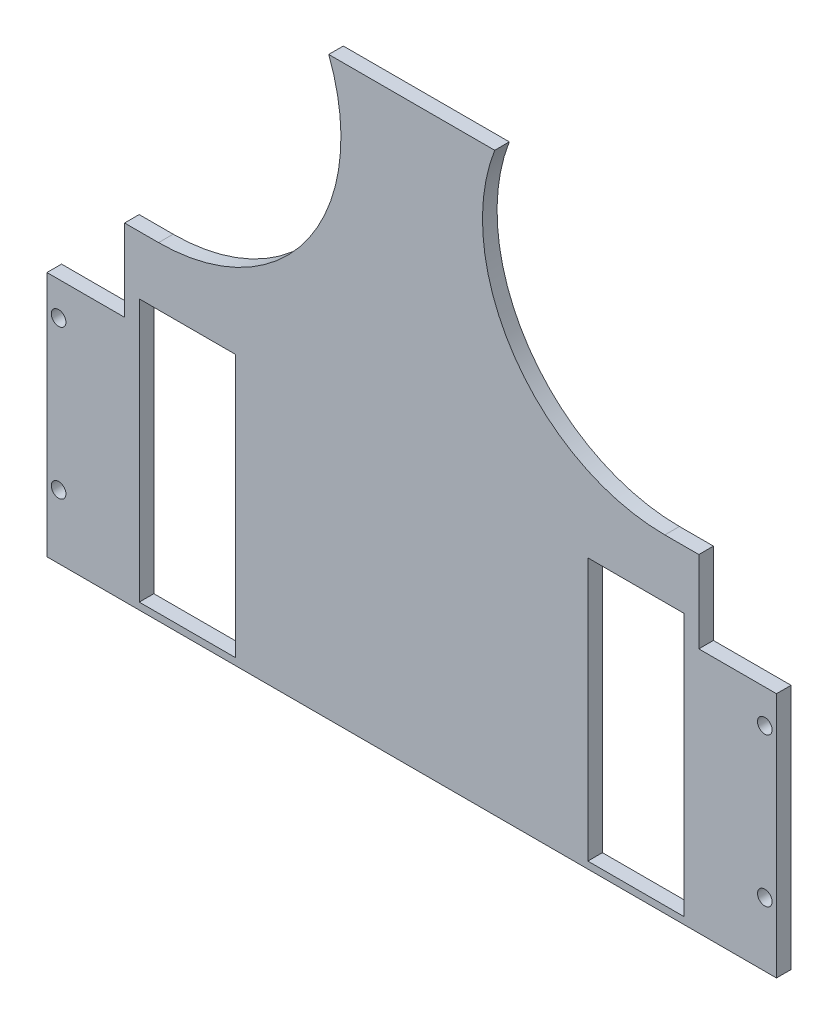
ISO-10303-21;
HEADER;
FILE_DESCRIPTION(('STEP AP214'),'2;1');
FILE_NAME('part.step','',(''),(''),'','','');
FILE_SCHEMA(('AUTOMOTIVE_DESIGN { 1 0 10303 214 1 1 1 1 }'));
ENDSEC;
DATA;
#1=APPLICATION_CONTEXT('core data for automotive mechanical design processes');
#2=APPLICATION_PROTOCOL_DEFINITION('international standard','automotive_design',2000,#1);
#3=PRODUCT_CONTEXT('',#1,'mechanical');
#4=PRODUCT('Part','Part','',(#3));
#5=PRODUCT_RELATED_PRODUCT_CATEGORY('part','',(#4));
#6=PRODUCT_DEFINITION_FORMATION('','',#4);
#7=PRODUCT_DEFINITION_CONTEXT('part definition',#1,'design');
#8=PRODUCT_DEFINITION('design','',#6,#7);
#9=PRODUCT_DEFINITION_SHAPE('','',#8);
#10=(LENGTH_UNIT() NAMED_UNIT(*) SI_UNIT(.MILLI.,.METRE.));
#11=(NAMED_UNIT(*) PLANE_ANGLE_UNIT() SI_UNIT($,.RADIAN.));
#12=(NAMED_UNIT(*) SI_UNIT($,.STERADIAN.) SOLID_ANGLE_UNIT());
#13=UNCERTAINTY_MEASURE_WITH_UNIT(LENGTH_MEASURE(1.E-05),#10,'distance_accuracy_value','');
#14=(GEOMETRIC_REPRESENTATION_CONTEXT(3) GLOBAL_UNCERTAINTY_ASSIGNED_CONTEXT((#13)) GLOBAL_UNIT_ASSIGNED_CONTEXT((#10,
#11,#12)) REPRESENTATION_CONTEXT('',''));
#15=CARTESIAN_POINT('',(0.,0.,0.));
#16=DIRECTION('',(0.,0.,1.));
#17=DIRECTION('',(1.,0.,0.));
#18=AXIS2_PLACEMENT_3D('',#15,#16,#17);
#19=CARTESIAN_POINT('',(0.,0.,5.));
#20=DIRECTION('',(0.,0.,1.));
#21=DIRECTION('',(1.,0.,0.));
#22=AXIS2_PLACEMENT_3D('',#19,#20,#21);
#23=PLANE('',#22);
#24=DIRECTION('',(1.,0.,0.));
#25=VECTOR('',#24,1.);
#26=CARTESIAN_POINT('',(-3397.43241786822,-182.000000000022,5.));
#27=LINE('',#26,#25);
#28=CARTESIAN_POINT('',(-3397.43241786822,-182.000000000022,5.));
#29=VERTEX_POINT('',#28);
#30=CARTESIAN_POINT('',(-3370.82807951019,-182.000000000022,5.));
#31=VERTEX_POINT('',#30);
#32=EDGE_CURVE('E338',#29,#31,#27,.T.);
#33=ORIENTED_EDGE('',*,*,#32,.F.);
#34=DIRECTION('',(0.,-1.,0.));
#35=VECTOR('',#34,1.);
#36=CARTESIAN_POINT('',(-3397.43241786822,-69.0000000000222,5.));
#37=LINE('',#36,#35);
#38=CARTESIAN_POINT('',(-3397.43241786822,-266.375602835039,5.));
#39=VERTEX_POINT('',#38);
#40=EDGE_CURVE('E204',#29,#39,#37,.T.);
#41=ORIENTED_EDGE('',*,*,#40,.T.);
#42=DIRECTION('',(-1.,0.,0.));
#43=VECTOR('',#42,1.);
#44=CARTESIAN_POINT('',(-3397.43241786822,-266.375602835039,5.));
#45=LINE('',#44,#43);
#46=CARTESIAN_POINT('',(-3147.43241786822,-266.375602835039,5.));
#47=VERTEX_POINT('',#46);
#48=EDGE_CURVE('E175',#47,#39,#45,.T.);
#49=ORIENTED_EDGE('',*,*,#48,.F.);
#50=DIRECTION('',(0.,1.,0.));
#51=VECTOR('',#50,1.);
#52=CARTESIAN_POINT('',(-3147.43241786822,-69.0000000000221,5.));
#53=LINE('',#52,#51);
#54=CARTESIAN_POINT('',(-3147.43241786822,-182.000000000022,5.));
#55=VERTEX_POINT('',#54);
#56=EDGE_CURVE('E44',#47,#55,#53,.T.);
#57=ORIENTED_EDGE('',*,*,#56,.T.);
#58=DIRECTION('',(1.,0.,0.));
#59=VECTOR('',#58,1.);
#60=CARTESIAN_POINT('',(-3147.43241786822,-182.000000000022,5.));
#61=LINE('',#60,#59);
#62=CARTESIAN_POINT('',(-3174.03675622624,-182.000000000022,5.));
#63=VERTEX_POINT('',#62);
#64=EDGE_CURVE('E300',#63,#55,#61,.T.);
#65=ORIENTED_EDGE('',*,*,#64,.F.);
#66=DIRECTION('',(0.,-1.,0.));
#67=VECTOR('',#66,1.);
#68=CARTESIAN_POINT('',(-3174.03675622624,-182.000000000022,5.));
#69=LINE('',#68,#67);
#70=CARTESIAN_POINT('',(-3174.03675622624,-154.000000000022,5.));
#71=VERTEX_POINT('',#70);
#72=EDGE_CURVE('E303',#71,#63,#69,.T.);
#73=ORIENTED_EDGE('',*,*,#72,.F.);
#74=DIRECTION('',(1.,0.,0.));
#75=VECTOR('',#74,1.);
#76=CARTESIAN_POINT('',(-3174.03675622624,-154.000000000022,5.));
#77=LINE('',#76,#75);
#78=CARTESIAN_POINT('',(-3185.68281037631,-154.000000000022,5.));
#79=VERTEX_POINT('',#78);
#80=EDGE_CURVE('E306',#79,#71,#77,.T.);
#81=ORIENTED_EDGE('',*,*,#80,.F.);
#82=CARTESIAN_POINT('',(-3185.68281037631,-91.5000000000222,5.));
#83=DIRECTION('',(0.,0.,1.));
#84=DIRECTION('',(-1.,0.,0.));
#85=AXIS2_PLACEMENT_3D('',#82,#83,#84);
#86=CIRCLE('',#85,62.5);
#87=CARTESIAN_POINT('',(-3243.99232932476,-69.0000000000221,5.));
#88=VERTEX_POINT('',#87);
#89=EDGE_CURVE('E180',#88,#79,#86,.T.);
#90=ORIENTED_EDGE('',*,*,#89,.F.);
#91=DIRECTION('',(-1.,0.,0.));
#92=VECTOR('',#91,1.);
#93=CARTESIAN_POINT('',(-3397.43241786822,-69.0000000000222,5.));
#94=LINE('',#93,#92);
#95=CARTESIAN_POINT('',(-3300.87250641167,-69.0000000000221,5.));
#96=VERTEX_POINT('',#95);
#97=EDGE_CURVE('E11',#88,#96,#94,.T.);
#98=ORIENTED_EDGE('',*,*,#97,.T.);
#99=CARTESIAN_POINT('',(-3359.18202536013,-91.5000000000221,5.));
#100=DIRECTION('',(0.,0.,1.));
#101=DIRECTION('',(1.,0.,0.));
#102=AXIS2_PLACEMENT_3D('',#99,#100,#101);
#103=CIRCLE('',#102,62.5);
#104=CARTESIAN_POINT('',(-3359.18202536013,-154.000000000022,5.));
#105=VERTEX_POINT('',#104);
#106=EDGE_CURVE('E60',#105,#96,#103,.T.);
#107=ORIENTED_EDGE('',*,*,#106,.F.);
#108=DIRECTION('',(1.,0.,0.));
#109=VECTOR('',#108,1.);
#110=CARTESIAN_POINT('',(-3370.82807951019,-154.000000000022,5.));
#111=LINE('',#110,#109);
#112=CARTESIAN_POINT('',(-3370.82807951019,-154.000000000022,5.));
#113=VERTEX_POINT('',#112);
#114=EDGE_CURVE('E332',#113,#105,#111,.T.);
#115=ORIENTED_EDGE('',*,*,#114,.F.);
#116=DIRECTION('',(0.,1.,0.));
#117=VECTOR('',#116,1.);
#118=CARTESIAN_POINT('',(-3370.82807951019,-182.000000000022,5.));
#119=LINE('',#118,#117);
#120=EDGE_CURVE('E335',#31,#113,#119,.T.);
#121=ORIENTED_EDGE('',*,*,#120,.F.);
#122=EDGE_LOOP('',(#33,#41,#49,#57,#65,#73,#81,#90,#98,#107,#115,#121));
#123=FACE_BOUND('',#122,.T.);
#124=CARTESIAN_POINT('',(-3393.43241786822,-244.500000000019,5.));
#125=DIRECTION('',(0.,0.,1.));
#126=DIRECTION('',(-1.,0.,0.));
#127=AXIS2_PLACEMENT_3D('',#124,#125,#126);
#128=CIRCLE('',#127,2.50000000000012);
#129=CARTESIAN_POINT('',(-3395.93241786822,-244.500000000019,5.));
#130=VERTEX_POINT('',#129);
#131=EDGE_CURVE('E243',#130,#130,#128,.T.);
#132=ORIENTED_EDGE('',*,*,#131,.F.);
#133=EDGE_LOOP('',(#132));
#134=FACE_BOUND('',#133,.T.);
#135=CARTESIAN_POINT('',(-3151.43241786822,-193.500000000019,5.));
#136=DIRECTION('',(0.,0.,1.));
#137=DIRECTION('',(1.,0.,0.));
#138=AXIS2_PLACEMENT_3D('',#135,#136,#137);
#139=CIRCLE('',#138,2.50000000000012);
#140=CARTESIAN_POINT('',(-3148.93241786822,-193.500000000019,5.));
#141=VERTEX_POINT('',#140);
#142=EDGE_CURVE('E226',#141,#141,#139,.T.);
#143=ORIENTED_EDGE('',*,*,#142,.F.);
#144=EDGE_LOOP('',(#143));
#145=FACE_BOUND('',#144,.T.);
#146=DIRECTION('',(1.,0.,0.));
#147=VECTOR('',#146,1.);
#148=CARTESIAN_POINT('',(-3212.07241786822,-264.00000000002,5.));
#149=LINE('',#148,#147);
#150=CARTESIAN_POINT('',(-3212.07241786822,-264.00000000002,5.));
#151=VERTEX_POINT('',#150);
#152=CARTESIAN_POINT('',(-3179.07241786822,-264.00000000002,5.));
#153=VERTEX_POINT('',#152);
#154=EDGE_CURVE('E231',#151,#153,#149,.T.);
#155=ORIENTED_EDGE('',*,*,#154,.F.);
#156=DIRECTION('',(0.,-1.,0.));
#157=VECTOR('',#156,1.);
#158=CARTESIAN_POINT('',(-3212.07241786822,-174.000000000017,5.));
#159=LINE('',#158,#157);
#160=CARTESIAN_POINT('',(-3212.07241786822,-174.000000000017,5.));
#161=VERTEX_POINT('',#160);
#162=EDGE_CURVE('E216',#161,#151,#159,.T.);
#163=ORIENTED_EDGE('',*,*,#162,.F.);
#164=DIRECTION('',(-1.,1.04293678070848E-13,0.));
#165=VECTOR('',#164,1.);
#166=CARTESIAN_POINT('',(-3212.07241786822,-174.000000000017,5.));
#167=LINE('',#166,#165);
#168=CARTESIAN_POINT('',(-3179.07241786822,-174.00000000002,5.));
#169=VERTEX_POINT('',#168);
#170=EDGE_CURVE('E212',#169,#161,#167,.T.);
#171=ORIENTED_EDGE('',*,*,#170,.F.);
#172=DIRECTION('',(0.,1.,0.));
#173=VECTOR('',#172,1.);
#174=CARTESIAN_POINT('',(-3179.07241786822,-174.00000000002,5.));
#175=LINE('',#174,#173);
#176=EDGE_CURVE('E228',#153,#169,#175,.T.);
#177=ORIENTED_EDGE('',*,*,#176,.F.);
#178=EDGE_LOOP('',(#155,#163,#171,#177));
#179=FACE_BOUND('',#178,.T.);
#180=CARTESIAN_POINT('',(-3151.43241786822,-244.500000000019,5.));
#181=DIRECTION('',(0.,0.,1.));
#182=DIRECTION('',(1.,0.,0.));
#183=AXIS2_PLACEMENT_3D('',#180,#181,#182);
#184=CIRCLE('',#183,2.50000000000012);
#185=CARTESIAN_POINT('',(-3148.93241786822,-244.500000000019,5.));
#186=VERTEX_POINT('',#185);
#187=EDGE_CURVE('E237',#186,#186,#184,.T.);
#188=ORIENTED_EDGE('',*,*,#187,.F.);
#189=EDGE_LOOP('',(#188));
#190=FACE_BOUND('',#189,.T.);
#191=CARTESIAN_POINT('',(-3393.43241786822,-193.500000000019,5.));
#192=DIRECTION('',(0.,0.,1.));
#193=DIRECTION('',(-1.,0.,0.));
#194=AXIS2_PLACEMENT_3D('',#191,#192,#193);
#195=CIRCLE('',#194,2.50000000000012);
#196=CARTESIAN_POINT('',(-3395.93241786822,-193.500000000019,5.));
#197=VERTEX_POINT('',#196);
#198=EDGE_CURVE('E249',#197,#197,#195,.T.);
#199=ORIENTED_EDGE('',*,*,#198,.F.);
#200=EDGE_LOOP('',(#199));
#201=FACE_BOUND('',#200,.T.);
#202=DIRECTION('',(0.,-1.,0.));
#203=VECTOR('',#202,1.);
#204=CARTESIAN_POINT('',(-3365.79241786822,-174.00000000002,5.));
#205=LINE('',#204,#203);
#206=CARTESIAN_POINT('',(-3365.79241786822,-174.00000000002,5.));
#207=VERTEX_POINT('',#206);
#208=CARTESIAN_POINT('',(-3365.79241786822,-264.000000000017,5.));
#209=VERTEX_POINT('',#208);
#210=EDGE_CURVE('E286',#207,#209,#205,.T.);
#211=ORIENTED_EDGE('',*,*,#210,.F.);
#212=DIRECTION('',(-1.,-1.04293678070848E-13,0.));
#213=VECTOR('',#212,1.);
#214=CARTESIAN_POINT('',(-3332.79241786822,-174.000000000017,5.));
#215=LINE('',#214,#213);
#216=CARTESIAN_POINT('',(-3332.79241786822,-174.000000000017,5.));
#217=VERTEX_POINT('',#216);
#218=EDGE_CURVE('E271',#217,#207,#215,.T.);
#219=ORIENTED_EDGE('',*,*,#218,.F.);
#220=DIRECTION('',(0.,1.,0.));
#221=VECTOR('',#220,1.);
#222=CARTESIAN_POINT('',(-3332.79241786822,-174.000000000017,5.));
#223=LINE('',#222,#221);
#224=CARTESIAN_POINT('',(-3332.79241786822,-264.00000000002,5.));
#225=VERTEX_POINT('',#224);
#226=EDGE_CURVE('E267',#225,#217,#223,.T.);
#227=ORIENTED_EDGE('',*,*,#226,.F.);
#228=DIRECTION('',(1.,-1.04293678070848E-13,0.));
#229=VECTOR('',#228,1.);
#230=CARTESIAN_POINT('',(-3332.79241786822,-264.00000000002,5.));
#231=LINE('',#230,#229);
#232=EDGE_CURVE('E283',#209,#225,#231,.T.);
#233=ORIENTED_EDGE('',*,*,#232,.F.);
#234=EDGE_LOOP('',(#211,#219,#227,#233));
#235=FACE_BOUND('',#234,.T.);
#236=ADVANCED_FACE('F35',(#123,#134,#145,#179,#190,#201,#235),#23,.T.);
#237=CARTESIAN_POINT('',(0.,0.,0.));
#238=DIRECTION('',(0.,0.,1.));
#239=DIRECTION('',(1.,0.,0.));
#240=AXIS2_PLACEMENT_3D('',#237,#238,#239);
#241=PLANE('',#240);
#242=DIRECTION('',(0.,-1.,0.));
#243=VECTOR('',#242,1.);
#244=CARTESIAN_POINT('',(-3397.43241786822,-69.0000000000222,0.));
#245=LINE('',#244,#243);
#246=CARTESIAN_POINT('',(-3397.43241786822,-182.000000000022,0.));
#247=VERTEX_POINT('',#246);
#248=CARTESIAN_POINT('',(-3397.43241786822,-266.375602835039,0.));
#249=VERTEX_POINT('',#248);
#250=EDGE_CURVE('E189',#247,#249,#245,.T.);
#251=ORIENTED_EDGE('',*,*,#250,.F.);
#252=DIRECTION('',(1.,0.,0.));
#253=VECTOR('',#252,1.);
#254=CARTESIAN_POINT('',(-3397.43241786822,-182.000000000022,0.));
#255=LINE('',#254,#253);
#256=CARTESIAN_POINT('',(-3370.82807951019,-182.000000000022,0.));
#257=VERTEX_POINT('',#256);
#258=EDGE_CURVE('E331',#247,#257,#255,.T.);
#259=ORIENTED_EDGE('',*,*,#258,.T.);
#260=DIRECTION('',(0.,1.,0.));
#261=VECTOR('',#260,1.);
#262=CARTESIAN_POINT('',(-3370.82807951019,-182.000000000022,0.));
#263=LINE('',#262,#261);
#264=CARTESIAN_POINT('',(-3370.82807951019,-154.000000000022,0.));
#265=VERTEX_POINT('',#264);
#266=EDGE_CURVE('E346',#257,#265,#263,.T.);
#267=ORIENTED_EDGE('',*,*,#266,.T.);
#268=DIRECTION('',(1.,0.,0.));
#269=VECTOR('',#268,1.);
#270=CARTESIAN_POINT('',(-3370.82807951019,-154.000000000022,0.));
#271=LINE('',#270,#269);
#272=CARTESIAN_POINT('',(-3359.18202536013,-154.000000000022,0.));
#273=VERTEX_POINT('',#272);
#274=EDGE_CURVE('E343',#265,#273,#271,.T.);
#275=ORIENTED_EDGE('',*,*,#274,.T.);
#276=CARTESIAN_POINT('',(-3359.18202536013,-91.5000000000221,0.));
#277=DIRECTION('',(0.,0.,1.));
#278=DIRECTION('',(1.,0.,0.));
#279=AXIS2_PLACEMENT_3D('',#276,#277,#278);
#280=CIRCLE('',#279,62.5);
#281=CARTESIAN_POINT('',(-3300.87250641167,-69.0000000000221,0.));
#282=VERTEX_POINT('',#281);
#283=EDGE_CURVE('E323',#273,#282,#280,.T.);
#284=ORIENTED_EDGE('',*,*,#283,.T.);
#285=DIRECTION('',(-1.,0.,0.));
#286=VECTOR('',#285,1.);
#287=CARTESIAN_POINT('',(-3397.43241786822,-69.0000000000222,0.));
#288=LINE('',#287,#286);
#289=CARTESIAN_POINT('',(-3243.99232932476,-69.0000000000221,0.));
#290=VERTEX_POINT('',#289);
#291=EDGE_CURVE('E39',#290,#282,#288,.T.);
#292=ORIENTED_EDGE('',*,*,#291,.F.);
#293=CARTESIAN_POINT('',(-3185.68281037631,-91.5000000000222,0.));
#294=DIRECTION('',(0.,0.,1.));
#295=DIRECTION('',(-1.,0.,0.));
#296=AXIS2_PLACEMENT_3D('',#293,#294,#295);
#297=CIRCLE('',#296,62.5);
#298=CARTESIAN_POINT('',(-3185.68281037631,-154.000000000022,0.));
#299=VERTEX_POINT('',#298);
#300=EDGE_CURVE('E302',#290,#299,#297,.T.);
#301=ORIENTED_EDGE('',*,*,#300,.T.);
#302=DIRECTION('',(1.,0.,0.));
#303=VECTOR('',#302,1.);
#304=CARTESIAN_POINT('',(-3174.03675622624,-154.000000000022,0.));
#305=LINE('',#304,#303);
#306=CARTESIAN_POINT('',(-3174.03675622624,-154.000000000022,0.));
#307=VERTEX_POINT('',#306);
#308=EDGE_CURVE('E315',#299,#307,#305,.T.);
#309=ORIENTED_EDGE('',*,*,#308,.T.);
#310=DIRECTION('',(0.,-1.,0.));
#311=VECTOR('',#310,1.);
#312=CARTESIAN_POINT('',(-3174.03675622624,-182.000000000022,0.));
#313=LINE('',#312,#311);
#314=CARTESIAN_POINT('',(-3174.03675622624,-182.000000000022,0.));
#315=VERTEX_POINT('',#314);
#316=EDGE_CURVE('E312',#307,#315,#313,.T.);
#317=ORIENTED_EDGE('',*,*,#316,.T.);
#318=DIRECTION('',(1.,0.,0.));
#319=VECTOR('',#318,1.);
#320=CARTESIAN_POINT('',(-3147.43241786822,-182.000000000022,0.));
#321=LINE('',#320,#319);
#322=CARTESIAN_POINT('',(-3147.43241786822,-182.000000000022,0.));
#323=VERTEX_POINT('',#322);
#324=EDGE_CURVE('E292',#315,#323,#321,.T.);
#325=ORIENTED_EDGE('',*,*,#324,.T.);
#326=DIRECTION('',(0.,1.,0.));
#327=VECTOR('',#326,1.);
#328=CARTESIAN_POINT('',(-3147.43241786822,-69.0000000000221,0.));
#329=LINE('',#328,#327);
#330=CARTESIAN_POINT('',(-3147.43241786822,-266.375602835039,0.));
#331=VERTEX_POINT('',#330);
#332=EDGE_CURVE('E192',#331,#323,#329,.T.);
#333=ORIENTED_EDGE('',*,*,#332,.F.);
#334=DIRECTION('',(-1.,0.,0.));
#335=VECTOR('',#334,1.);
#336=CARTESIAN_POINT('',(-3397.43241786822,-266.375602835039,0.));
#337=LINE('',#336,#335);
#338=EDGE_CURVE('E52',#331,#249,#337,.T.);
#339=ORIENTED_EDGE('',*,*,#338,.T.);
#340=EDGE_LOOP('',(#251,#259,#267,#275,#284,#292,#301,#309,#317,#325,#333,#339));
#341=FACE_BOUND('',#340,.T.);
#342=CARTESIAN_POINT('',(-3393.43241786822,-193.500000000019,0.));
#343=DIRECTION('',(0.,0.,1.));
#344=DIRECTION('',(-1.,0.,0.));
#345=AXIS2_PLACEMENT_3D('',#342,#343,#344);
#346=CIRCLE('',#345,2.50000000000012);
#347=CARTESIAN_POINT('',(-3395.93241786822,-193.500000000019,0.));
#348=VERTEX_POINT('',#347);
#349=EDGE_CURVE('E252',#348,#348,#346,.T.);
#350=ORIENTED_EDGE('',*,*,#349,.T.);
#351=EDGE_LOOP('',(#350));
#352=FACE_BOUND('',#351,.T.);
#353=CARTESIAN_POINT('',(-3393.43241786822,-244.500000000019,0.));
#354=DIRECTION('',(0.,0.,1.));
#355=DIRECTION('',(-1.,0.,0.));
#356=AXIS2_PLACEMENT_3D('',#353,#354,#355);
#357=CIRCLE('',#356,2.50000000000012);
#358=CARTESIAN_POINT('',(-3395.93241786822,-244.500000000019,0.));
#359=VERTEX_POINT('',#358);
#360=EDGE_CURVE('E246',#359,#359,#357,.T.);
#361=ORIENTED_EDGE('',*,*,#360,.T.);
#362=EDGE_LOOP('',(#361));
#363=FACE_BOUND('',#362,.T.);
#364=CARTESIAN_POINT('',(-3151.43241786822,-244.500000000019,0.));
#365=DIRECTION('',(0.,0.,1.));
#366=DIRECTION('',(1.,0.,0.));
#367=AXIS2_PLACEMENT_3D('',#364,#365,#366);
#368=CIRCLE('',#367,2.50000000000012);
#369=CARTESIAN_POINT('',(-3148.93241786822,-244.500000000019,0.));
#370=VERTEX_POINT('',#369);
#371=EDGE_CURVE('E240',#370,#370,#368,.T.);
#372=ORIENTED_EDGE('',*,*,#371,.T.);
#373=EDGE_LOOP('',(#372));
#374=FACE_BOUND('',#373,.T.);
#375=CARTESIAN_POINT('',(-3151.43241786822,-193.500000000019,0.));
#376=DIRECTION('',(0.,0.,1.));
#377=DIRECTION('',(1.,0.,0.));
#378=AXIS2_PLACEMENT_3D('',#375,#376,#377);
#379=CIRCLE('',#378,2.50000000000012);
#380=CARTESIAN_POINT('',(-3148.93241786822,-193.500000000019,0.));
#381=VERTEX_POINT('',#380);
#382=EDGE_CURVE('E234',#381,#381,#379,.T.);
#383=ORIENTED_EDGE('',*,*,#382,.T.);
#384=EDGE_LOOP('',(#383));
#385=FACE_BOUND('',#384,.T.);
#386=DIRECTION('',(0.,-1.,0.));
#387=VECTOR('',#386,1.);
#388=CARTESIAN_POINT('',(-3212.07241786822,-174.000000000017,0.));
#389=LINE('',#388,#387);
#390=CARTESIAN_POINT('',(-3212.07241786822,-174.000000000017,0.));
#391=VERTEX_POINT('',#390);
#392=CARTESIAN_POINT('',(-3212.07241786822,-264.00000000002,0.));
#393=VERTEX_POINT('',#392);
#394=EDGE_CURVE('E223',#391,#393,#389,.T.);
#395=ORIENTED_EDGE('',*,*,#394,.T.);
#396=DIRECTION('',(1.,0.,0.));
#397=VECTOR('',#396,1.);
#398=CARTESIAN_POINT('',(-3212.07241786822,-264.00000000002,0.));
#399=LINE('',#398,#397);
#400=CARTESIAN_POINT('',(-3179.07241786822,-264.00000000002,0.));
#401=VERTEX_POINT('',#400);
#402=EDGE_CURVE('E220',#393,#401,#399,.T.);
#403=ORIENTED_EDGE('',*,*,#402,.T.);
#404=DIRECTION('',(0.,1.,0.));
#405=VECTOR('',#404,1.);
#406=CARTESIAN_POINT('',(-3179.07241786822,-174.00000000002,0.));
#407=LINE('',#406,#405);
#408=CARTESIAN_POINT('',(-3179.07241786822,-174.00000000002,0.));
#409=VERTEX_POINT('',#408);
#410=EDGE_CURVE('E217',#401,#409,#407,.T.);
#411=ORIENTED_EDGE('',*,*,#410,.T.);
#412=DIRECTION('',(-1.,1.04293678070848E-13,0.));
#413=VECTOR('',#412,1.);
#414=CARTESIAN_POINT('',(-3212.07241786822,-174.000000000017,0.));
#415=LINE('',#414,#413);
#416=EDGE_CURVE('E213',#409,#391,#415,.T.);
#417=ORIENTED_EDGE('',*,*,#416,.T.);
#418=EDGE_LOOP('',(#395,#403,#411,#417));
#419=FACE_BOUND('',#418,.T.);
#420=DIRECTION('',(-1.,-1.04293678070848E-13,0.));
#421=VECTOR('',#420,1.);
#422=CARTESIAN_POINT('',(-3332.79241786822,-174.000000000017,0.));
#423=LINE('',#422,#421);
#424=CARTESIAN_POINT('',(-3332.79241786822,-174.000000000017,0.));
#425=VERTEX_POINT('',#424);
#426=CARTESIAN_POINT('',(-3365.79241786822,-174.00000000002,0.));
#427=VERTEX_POINT('',#426);
#428=EDGE_CURVE('E278',#425,#427,#423,.T.);
#429=ORIENTED_EDGE('',*,*,#428,.T.);
#430=DIRECTION('',(0.,-1.,0.));
#431=VECTOR('',#430,1.);
#432=CARTESIAN_POINT('',(-3365.79241786822,-174.00000000002,0.));
#433=LINE('',#432,#431);
#434=CARTESIAN_POINT('',(-3365.79241786822,-264.000000000017,0.));
#435=VERTEX_POINT('',#434);
#436=EDGE_CURVE('E275',#427,#435,#433,.T.);
#437=ORIENTED_EDGE('',*,*,#436,.T.);
#438=DIRECTION('',(1.,-1.04293678070848E-13,0.));
#439=VECTOR('',#438,1.);
#440=CARTESIAN_POINT('',(-3332.79241786822,-264.00000000002,0.));
#441=LINE('',#440,#439);
#442=CARTESIAN_POINT('',(-3332.79241786822,-264.00000000002,0.));
#443=VERTEX_POINT('',#442);
#444=EDGE_CURVE('E272',#435,#443,#441,.T.);
#445=ORIENTED_EDGE('',*,*,#444,.T.);
#446=DIRECTION('',(0.,1.,0.));
#447=VECTOR('',#446,1.);
#448=CARTESIAN_POINT('',(-3332.79241786822,-174.000000000017,0.));
#449=LINE('',#448,#447);
#450=EDGE_CURVE('E268',#443,#425,#449,.T.);
#451=ORIENTED_EDGE('',*,*,#450,.T.);
#452=EDGE_LOOP('',(#429,#437,#445,#451));
#453=FACE_BOUND('',#452,.T.);
#454=ADVANCED_FACE('F186',(#341,#352,#363,#374,#385,#419,#453),#241,.F.);
#455=CARTESIAN_POINT('',(-3397.43241786822,-69.0000000000222,5.));
#456=DIRECTION('',(1.,0.,0.));
#457=DIRECTION('',(0.,0.,-1.));
#458=AXIS2_PLACEMENT_3D('',#455,#456,#457);
#459=PLANE('',#458);
#460=ORIENTED_EDGE('',*,*,#40,.F.);
#461=DIRECTION('',(0.,0.,1.));
#462=VECTOR('',#461,1.);
#463=CARTESIAN_POINT('',(-3397.43241786822,-182.000000000022,0.));
#464=LINE('',#463,#462);
#465=EDGE_CURVE('E195',#247,#29,#464,.T.);
#466=ORIENTED_EDGE('',*,*,#465,.F.);
#467=ORIENTED_EDGE('',*,*,#250,.T.);
#468=DIRECTION('',(0.,0.,1.));
#469=VECTOR('',#468,1.);
#470=CARTESIAN_POINT('',(-3397.43241786822,-266.375602835039,0.));
#471=LINE('',#470,#469);
#472=EDGE_CURVE('E172',#249,#39,#471,.T.);
#473=ORIENTED_EDGE('',*,*,#472,.T.);
#474=EDGE_LOOP('',(#460,#466,#467,#473));
#475=FACE_BOUND('',#474,.T.);
#476=ADVANCED_FACE('F37',(#475),#459,.F.);
#477=CARTESIAN_POINT('',(-3147.43241786822,-69.0000000000221,5.));
#478=DIRECTION('',(-1.,0.,0.));
#479=DIRECTION('',(0.,0.,1.));
#480=AXIS2_PLACEMENT_3D('',#477,#478,#479);
#481=PLANE('',#480);
#482=ORIENTED_EDGE('',*,*,#56,.F.);
#483=DIRECTION('',(0.,0.,1.));
#484=VECTOR('',#483,1.);
#485=CARTESIAN_POINT('',(-3147.43241786822,-266.375602835039,0.));
#486=LINE('',#485,#484);
#487=EDGE_CURVE('E181',#331,#47,#486,.T.);
#488=ORIENTED_EDGE('',*,*,#487,.F.);
#489=ORIENTED_EDGE('',*,*,#332,.T.);
#490=DIRECTION('',(0.,0.,1.));
#491=VECTOR('',#490,1.);
#492=CARTESIAN_POINT('',(-3147.43241786822,-182.000000000022,0.));
#493=LINE('',#492,#491);
#494=EDGE_CURVE('E296',#323,#55,#493,.T.);
#495=ORIENTED_EDGE('',*,*,#494,.T.);
#496=EDGE_LOOP('',(#482,#488,#489,#495));
#497=FACE_BOUND('',#496,.T.);
#498=ADVANCED_FACE('F357',(#497),#481,.F.);
#499=CARTESIAN_POINT('',(-3397.43241786822,-69.0000000000222,5.));
#500=DIRECTION('',(0.,-1.,0.));
#501=DIRECTION('',(1.,0.,0.));
#502=AXIS2_PLACEMENT_3D('',#499,#500,#501);
#503=PLANE('',#502);
#504=ORIENTED_EDGE('',*,*,#291,.T.);
#505=DIRECTION('',(0.,0.,1.));
#506=VECTOR('',#505,1.);
#507=CARTESIAN_POINT('',(-3300.87250641167,-69.0000000000221,0.));
#508=LINE('',#507,#506);
#509=EDGE_CURVE('E327',#282,#96,#508,.T.);
#510=ORIENTED_EDGE('',*,*,#509,.T.);
#511=ORIENTED_EDGE('',*,*,#97,.F.);
#512=DIRECTION('',(0.,0.,1.));
#513=VECTOR('',#512,1.);
#514=CARTESIAN_POINT('',(-3243.99232932476,-69.0000000000221,0.));
#515=LINE('',#514,#513);
#516=EDGE_CURVE('E281',#290,#88,#515,.T.);
#517=ORIENTED_EDGE('',*,*,#516,.F.);
#518=EDGE_LOOP('',(#504,#510,#511,#517));
#519=FACE_BOUND('',#518,.T.);
#520=ADVANCED_FACE('F377',(#519),#503,.F.);
#521=CARTESIAN_POINT('',(-3212.07241786822,-174.000000000017,5.));
#522=DIRECTION('',(1.,0.,0.));
#523=DIRECTION('',(0.,0.,-1.));
#524=AXIS2_PLACEMENT_3D('',#521,#522,#523);
#525=PLANE('',#524);
#526=ORIENTED_EDGE('',*,*,#394,.F.);
#527=DIRECTION('',(0.,0.,-1.));
#528=VECTOR('',#527,1.);
#529=CARTESIAN_POINT('',(-3212.07241786822,-174.000000000017,5.));
#530=LINE('',#529,#528);
#531=EDGE_CURVE('E209',#161,#391,#530,.T.);
#532=ORIENTED_EDGE('',*,*,#531,.F.);
#533=ORIENTED_EDGE('',*,*,#162,.T.);
#534=DIRECTION('',(0.,0.,-1.));
#535=VECTOR('',#534,1.);
#536=CARTESIAN_POINT('',(-3212.07241786822,-264.00000000002,5.));
#537=LINE('',#536,#535);
#538=EDGE_CURVE('E196',#151,#393,#537,.T.);
#539=ORIENTED_EDGE('',*,*,#538,.T.);
#540=EDGE_LOOP('',(#526,#532,#533,#539));
#541=FACE_BOUND('',#540,.T.);
#542=ADVANCED_FACE('F407',(#541),#525,.T.);
#543=CARTESIAN_POINT('',(-3212.07241786822,-264.00000000002,5.));
#544=DIRECTION('',(0.,1.,0.));
#545=DIRECTION('',(0.,0.,1.));
#546=AXIS2_PLACEMENT_3D('',#543,#544,#545);
#547=PLANE('',#546);
#548=ORIENTED_EDGE('',*,*,#402,.F.);
#549=ORIENTED_EDGE('',*,*,#538,.F.);
#550=ORIENTED_EDGE('',*,*,#154,.T.);
#551=DIRECTION('',(0.,0.,-1.));
#552=VECTOR('',#551,1.);
#553=CARTESIAN_POINT('',(-3179.07241786822,-264.00000000002,5.));
#554=LINE('',#553,#552);
#555=EDGE_CURVE('E199',#153,#401,#554,.T.);
#556=ORIENTED_EDGE('',*,*,#555,.T.);
#557=EDGE_LOOP('',(#548,#549,#550,#556));
#558=FACE_BOUND('',#557,.T.);
#559=ADVANCED_FACE('F527',(#558),#547,.T.);
#560=CARTESIAN_POINT('',(-3179.07241786822,-174.00000000002,5.));
#561=DIRECTION('',(-1.,0.,0.));
#562=DIRECTION('',(0.,0.,1.));
#563=AXIS2_PLACEMENT_3D('',#560,#561,#562);
#564=PLANE('',#563);
#565=ORIENTED_EDGE('',*,*,#410,.F.);
#566=ORIENTED_EDGE('',*,*,#555,.F.);
#567=ORIENTED_EDGE('',*,*,#176,.T.);
#568=DIRECTION('',(0.,0.,-1.));
#569=VECTOR('',#568,1.);
#570=CARTESIAN_POINT('',(-3179.07241786822,-174.00000000002,5.));
#571=LINE('',#570,#569);
#572=EDGE_CURVE('E207',#169,#409,#571,.T.);
#573=ORIENTED_EDGE('',*,*,#572,.T.);
#574=EDGE_LOOP('',(#565,#566,#567,#573));
#575=FACE_BOUND('',#574,.T.);
#576=ADVANCED_FACE('F517',(#575),#564,.T.);
#577=CARTESIAN_POINT('',(-3212.07241786822,-174.000000000017,5.));
#578=DIRECTION('',(-1.04293678070848E-13,-1.,0.));
#579=DIRECTION('',(1.,-1.04293678070848E-13,0.));
#580=AXIS2_PLACEMENT_3D('',#577,#578,#579);
#581=PLANE('',#580);
#582=ORIENTED_EDGE('',*,*,#416,.F.);
#583=ORIENTED_EDGE('',*,*,#572,.F.);
#584=ORIENTED_EDGE('',*,*,#170,.T.);
#585=ORIENTED_EDGE('',*,*,#531,.T.);
#586=EDGE_LOOP('',(#582,#583,#584,#585));
#587=FACE_BOUND('',#586,.T.);
#588=ADVANCED_FACE('F507',(#587),#581,.T.);
#589=CARTESIAN_POINT('',(-3151.43241786822,-193.500000000019,5.));
#590=DIRECTION('',(0.,0.,-1.));
#591=DIRECTION('',(-1.,0.,0.));
#592=AXIS2_PLACEMENT_3D('',#589,#590,#591);
#593=CYLINDRICAL_SURFACE('',#592,2.50000000000012);
#594=ORIENTED_EDGE('',*,*,#142,.T.);
#595=EDGE_LOOP('',(#594));
#596=FACE_BOUND('',#595,.T.);
#597=ORIENTED_EDGE('',*,*,#382,.F.);
#598=EDGE_LOOP('',(#597));
#599=FACE_BOUND('',#598,.T.);
#600=ADVANCED_FACE('F497',(#596,#599),#593,.F.);
#601=CARTESIAN_POINT('',(-3151.43241786822,-244.500000000019,5.));
#602=DIRECTION('',(0.,0.,-1.));
#603=DIRECTION('',(-1.,0.,0.));
#604=AXIS2_PLACEMENT_3D('',#601,#602,#603);
#605=CYLINDRICAL_SURFACE('',#604,2.50000000000012);
#606=ORIENTED_EDGE('',*,*,#187,.T.);
#607=EDGE_LOOP('',(#606));
#608=FACE_BOUND('',#607,.T.);
#609=ORIENTED_EDGE('',*,*,#371,.F.);
#610=EDGE_LOOP('',(#609));
#611=FACE_BOUND('',#610,.T.);
#612=ADVANCED_FACE('F487',(#608,#611),#605,.F.);
#613=CARTESIAN_POINT('',(-3393.43241786822,-244.500000000019,5.));
#614=DIRECTION('',(0.,0.,-1.));
#615=DIRECTION('',(-1.,0.,0.));
#616=AXIS2_PLACEMENT_3D('',#613,#614,#615);
#617=CYLINDRICAL_SURFACE('',#616,2.50000000000012);
#618=ORIENTED_EDGE('',*,*,#131,.T.);
#619=EDGE_LOOP('',(#618));
#620=FACE_BOUND('',#619,.T.);
#621=ORIENTED_EDGE('',*,*,#360,.F.);
#622=EDGE_LOOP('',(#621));
#623=FACE_BOUND('',#622,.T.);
#624=ADVANCED_FACE('F477',(#620,#623),#617,.F.);
#625=CARTESIAN_POINT('',(-3393.43241786822,-193.500000000019,5.));
#626=DIRECTION('',(0.,0.,-1.));
#627=DIRECTION('',(-1.,0.,0.));
#628=AXIS2_PLACEMENT_3D('',#625,#626,#627);
#629=CYLINDRICAL_SURFACE('',#628,2.50000000000012);
#630=ORIENTED_EDGE('',*,*,#198,.T.);
#631=EDGE_LOOP('',(#630));
#632=FACE_BOUND('',#631,.T.);
#633=ORIENTED_EDGE('',*,*,#349,.F.);
#634=EDGE_LOOP('',(#633));
#635=FACE_BOUND('',#634,.T.);
#636=ADVANCED_FACE('F467',(#632,#635),#629,.F.);
#637=CARTESIAN_POINT('',(-3332.79241786822,-174.000000000017,5.));
#638=DIRECTION('',(1.04293678070848E-13,-1.,0.));
#639=DIRECTION('',(1.,1.04293678070848E-13,0.));
#640=AXIS2_PLACEMENT_3D('',#637,#638,#639);
#641=PLANE('',#640);
#642=ORIENTED_EDGE('',*,*,#428,.F.);
#643=DIRECTION('',(0.,0.,-1.));
#644=VECTOR('',#643,1.);
#645=CARTESIAN_POINT('',(-3332.79241786822,-174.000000000017,5.));
#646=LINE('',#645,#644);
#647=EDGE_CURVE('E264',#217,#425,#646,.T.);
#648=ORIENTED_EDGE('',*,*,#647,.F.);
#649=ORIENTED_EDGE('',*,*,#218,.T.);
#650=DIRECTION('',(0.,0.,-1.));
#651=VECTOR('',#650,1.);
#652=CARTESIAN_POINT('',(-3365.79241786822,-174.00000000002,5.));
#653=LINE('',#652,#651);
#654=EDGE_CURVE('E255',#207,#427,#653,.T.);
#655=ORIENTED_EDGE('',*,*,#654,.T.);
#656=EDGE_LOOP('',(#642,#648,#649,#655));
#657=FACE_BOUND('',#656,.T.);
#658=ADVANCED_FACE('F457',(#657),#641,.T.);
#659=CARTESIAN_POINT('',(-3365.79241786822,-174.00000000002,5.));
#660=DIRECTION('',(1.,0.,0.));
#661=DIRECTION('',(0.,0.,-1.));
#662=AXIS2_PLACEMENT_3D('',#659,#660,#661);
#663=PLANE('',#662);
#664=ORIENTED_EDGE('',*,*,#436,.F.);
#665=ORIENTED_EDGE('',*,*,#654,.F.);
#666=ORIENTED_EDGE('',*,*,#210,.T.);
#667=DIRECTION('',(0.,0.,-1.));
#668=VECTOR('',#667,1.);
#669=CARTESIAN_POINT('',(-3365.79241786822,-264.000000000017,5.));
#670=LINE('',#669,#668);
#671=EDGE_CURVE('E260',#209,#435,#670,.T.);
#672=ORIENTED_EDGE('',*,*,#671,.T.);
#673=EDGE_LOOP('',(#664,#665,#666,#672));
#674=FACE_BOUND('',#673,.T.);
#675=ADVANCED_FACE('F447',(#674),#663,.T.);
#676=CARTESIAN_POINT('',(-3332.79241786822,-264.00000000002,5.));
#677=DIRECTION('',(1.04293678070848E-13,1.,0.));
#678=DIRECTION('',(-1.,1.04293678070848E-13,0.));
#679=AXIS2_PLACEMENT_3D('',#676,#677,#678);
#680=PLANE('',#679);
#681=ORIENTED_EDGE('',*,*,#444,.F.);
#682=ORIENTED_EDGE('',*,*,#671,.F.);
#683=ORIENTED_EDGE('',*,*,#232,.T.);
#684=DIRECTION('',(0.,0.,-1.));
#685=VECTOR('',#684,1.);
#686=CARTESIAN_POINT('',(-3332.79241786822,-264.00000000002,5.));
#687=LINE('',#686,#685);
#688=EDGE_CURVE('E262',#225,#443,#687,.T.);
#689=ORIENTED_EDGE('',*,*,#688,.T.);
#690=EDGE_LOOP('',(#681,#682,#683,#689));
#691=FACE_BOUND('',#690,.T.);
#692=ADVANCED_FACE('F435',(#691),#680,.T.);
#693=CARTESIAN_POINT('',(-3332.79241786822,-174.000000000017,5.));
#694=DIRECTION('',(-1.,0.,0.));
#695=DIRECTION('',(0.,0.,1.));
#696=AXIS2_PLACEMENT_3D('',#693,#694,#695);
#697=PLANE('',#696);
#698=ORIENTED_EDGE('',*,*,#450,.F.);
#699=ORIENTED_EDGE('',*,*,#688,.F.);
#700=ORIENTED_EDGE('',*,*,#226,.T.);
#701=ORIENTED_EDGE('',*,*,#647,.T.);
#702=EDGE_LOOP('',(#698,#699,#700,#701));
#703=FACE_BOUND('',#702,.T.);
#704=ADVANCED_FACE('F430',(#703),#697,.T.);
#705=CARTESIAN_POINT('',(-3185.68281037631,-91.5000000000222,0.));
#706=DIRECTION('',(0.,0.,1.));
#707=DIRECTION('',(1.,0.,0.));
#708=AXIS2_PLACEMENT_3D('',#705,#706,#707);
#709=CYLINDRICAL_SURFACE('',#708,62.5);
#710=ORIENTED_EDGE('',*,*,#89,.T.);
#711=DIRECTION('',(0.,0.,1.));
#712=VECTOR('',#711,1.);
#713=CARTESIAN_POINT('',(-3185.68281037631,-154.000000000022,0.));
#714=LINE('',#713,#712);
#715=EDGE_CURVE('E289',#299,#79,#714,.T.);
#716=ORIENTED_EDGE('',*,*,#715,.F.);
#717=ORIENTED_EDGE('',*,*,#300,.F.);
#718=ORIENTED_EDGE('',*,*,#516,.T.);
#719=EDGE_LOOP('',(#710,#716,#717,#718));
#720=FACE_BOUND('',#719,.T.);
#721=ADVANCED_FACE('F372',(#720),#709,.F.);
#722=CARTESIAN_POINT('',(-3147.43241786822,-182.000000000022,0.));
#723=DIRECTION('',(0.,-1.,0.));
#724=DIRECTION('',(0.,0.,-1.));
#725=AXIS2_PLACEMENT_3D('',#722,#723,#724);
#726=PLANE('',#725);
#727=ORIENTED_EDGE('',*,*,#64,.T.);
#728=ORIENTED_EDGE('',*,*,#494,.F.);
#729=ORIENTED_EDGE('',*,*,#324,.F.);
#730=DIRECTION('',(0.,0.,1.));
#731=VECTOR('',#730,1.);
#732=CARTESIAN_POINT('',(-3174.03675622624,-182.000000000022,0.));
#733=LINE('',#732,#731);
#734=EDGE_CURVE('E294',#315,#63,#733,.T.);
#735=ORIENTED_EDGE('',*,*,#734,.T.);
#736=EDGE_LOOP('',(#727,#728,#729,#735));
#737=FACE_BOUND('',#736,.T.);
#738=ADVANCED_FACE('F360',(#737),#726,.F.);
#739=CARTESIAN_POINT('',(-3174.03675622624,-182.000000000022,0.));
#740=DIRECTION('',(-1.,0.,0.));
#741=DIRECTION('',(0.,0.,1.));
#742=AXIS2_PLACEMENT_3D('',#739,#740,#741);
#743=PLANE('',#742);
#744=ORIENTED_EDGE('',*,*,#72,.T.);
#745=ORIENTED_EDGE('',*,*,#734,.F.);
#746=ORIENTED_EDGE('',*,*,#316,.F.);
#747=DIRECTION('',(0.,0.,1.));
#748=VECTOR('',#747,1.);
#749=CARTESIAN_POINT('',(-3174.03675622624,-154.000000000022,0.));
#750=LINE('',#749,#748);
#751=EDGE_CURVE('E291',#307,#71,#750,.T.);
#752=ORIENTED_EDGE('',*,*,#751,.T.);
#753=EDGE_LOOP('',(#744,#745,#746,#752));
#754=FACE_BOUND('',#753,.T.);
#755=ADVANCED_FACE('F364',(#754),#743,.F.);
#756=CARTESIAN_POINT('',(-3174.03675622624,-154.000000000022,0.));
#757=DIRECTION('',(0.,-1.,0.));
#758=DIRECTION('',(0.,0.,-1.));
#759=AXIS2_PLACEMENT_3D('',#756,#757,#758);
#760=PLANE('',#759);
#761=ORIENTED_EDGE('',*,*,#80,.T.);
#762=ORIENTED_EDGE('',*,*,#751,.F.);
#763=ORIENTED_EDGE('',*,*,#308,.F.);
#764=ORIENTED_EDGE('',*,*,#715,.T.);
#765=EDGE_LOOP('',(#761,#762,#763,#764));
#766=FACE_BOUND('',#765,.T.);
#767=ADVANCED_FACE('F370',(#766),#760,.F.);
#768=CARTESIAN_POINT('',(-3397.43241786822,-182.000000000022,0.));
#769=DIRECTION('',(0.,-1.,0.));
#770=DIRECTION('',(0.,0.,-1.));
#771=AXIS2_PLACEMENT_3D('',#768,#769,#770);
#772=PLANE('',#771);
#773=ORIENTED_EDGE('',*,*,#32,.T.);
#774=DIRECTION('',(0.,0.,1.));
#775=VECTOR('',#774,1.);
#776=CARTESIAN_POINT('',(-3370.82807951019,-182.000000000022,0.));
#777=LINE('',#776,#775);
#778=EDGE_CURVE('E320',#257,#31,#777,.T.);
#779=ORIENTED_EDGE('',*,*,#778,.F.);
#780=ORIENTED_EDGE('',*,*,#258,.F.);
#781=ORIENTED_EDGE('',*,*,#465,.T.);
#782=EDGE_LOOP('',(#773,#779,#780,#781));
#783=FACE_BOUND('',#782,.T.);
#784=ADVANCED_FACE('F389',(#783),#772,.F.);
#785=CARTESIAN_POINT('',(-3359.18202536013,-91.5000000000221,0.));
#786=DIRECTION('',(0.,0.,1.));
#787=DIRECTION('',(1.,0.,0.));
#788=AXIS2_PLACEMENT_3D('',#785,#786,#787);
#789=CYLINDRICAL_SURFACE('',#788,62.5);
#790=ORIENTED_EDGE('',*,*,#106,.T.);
#791=ORIENTED_EDGE('',*,*,#509,.F.);
#792=ORIENTED_EDGE('',*,*,#283,.F.);
#793=DIRECTION('',(0.,0.,1.));
#794=VECTOR('',#793,1.);
#795=CARTESIAN_POINT('',(-3359.18202536013,-154.000000000022,0.));
#796=LINE('',#795,#794);
#797=EDGE_CURVE('E325',#273,#105,#796,.T.);
#798=ORIENTED_EDGE('',*,*,#797,.T.);
#799=EDGE_LOOP('',(#790,#791,#792,#798));
#800=FACE_BOUND('',#799,.T.);
#801=ADVANCED_FACE('F380',(#800),#789,.F.);
#802=CARTESIAN_POINT('',(-3370.82807951019,-154.000000000022,0.));
#803=DIRECTION('',(0.,-1.,0.));
#804=DIRECTION('',(0.,0.,-1.));
#805=AXIS2_PLACEMENT_3D('',#802,#803,#804);
#806=PLANE('',#805);
#807=ORIENTED_EDGE('',*,*,#114,.T.);
#808=ORIENTED_EDGE('',*,*,#797,.F.);
#809=ORIENTED_EDGE('',*,*,#274,.F.);
#810=DIRECTION('',(0.,0.,1.));
#811=VECTOR('',#810,1.);
#812=CARTESIAN_POINT('',(-3370.82807951019,-154.000000000022,0.));
#813=LINE('',#812,#811);
#814=EDGE_CURVE('E322',#265,#113,#813,.T.);
#815=ORIENTED_EDGE('',*,*,#814,.T.);
#816=EDGE_LOOP('',(#807,#808,#809,#815));
#817=FACE_BOUND('',#816,.T.);
#818=ADVANCED_FACE('F384',(#817),#806,.F.);
#819=CARTESIAN_POINT('',(-3370.82807951019,-182.000000000022,0.));
#820=DIRECTION('',(1.,0.,0.));
#821=DIRECTION('',(0.,0.,-1.));
#822=AXIS2_PLACEMENT_3D('',#819,#820,#821);
#823=PLANE('',#822);
#824=ORIENTED_EDGE('',*,*,#120,.T.);
#825=ORIENTED_EDGE('',*,*,#814,.F.);
#826=ORIENTED_EDGE('',*,*,#266,.F.);
#827=ORIENTED_EDGE('',*,*,#778,.T.);
#828=EDGE_LOOP('',(#824,#825,#826,#827));
#829=FACE_BOUND('',#828,.T.);
#830=ADVANCED_FACE('F387',(#829),#823,.F.);
#831=CARTESIAN_POINT('',(-3397.43241786822,-266.375602835039,0.));
#832=DIRECTION('',(0.,1.,0.));
#833=DIRECTION('',(0.,0.,1.));
#834=AXIS2_PLACEMENT_3D('',#831,#832,#833);
#835=PLANE('',#834);
#836=ORIENTED_EDGE('',*,*,#48,.T.);
#837=ORIENTED_EDGE('',*,*,#472,.F.);
#838=ORIENTED_EDGE('',*,*,#338,.F.);
#839=ORIENTED_EDGE('',*,*,#487,.T.);
#840=EDGE_LOOP('',(#836,#837,#838,#839));
#841=FACE_BOUND('',#840,.T.);
#842=ADVANCED_FACE('F173',(#841),#835,.F.);
#843=CLOSED_SHELL('',(#236,#454,#476,#498,#520,#542,#559,#576,#588,#600,#612,#624,#636,#658,
#675,#692,#704,#721,#738,#755,#767,#784,#801,#818,#830,#842));
#844=MANIFOLD_SOLID_BREP('B2',#843);
#845=ADVANCED_BREP_SHAPE_REPRESENTATION('',(#18,#844),#14);
#846=SHAPE_DEFINITION_REPRESENTATION(#9,#845);
ENDSEC;
END-ISO-10303-21;
